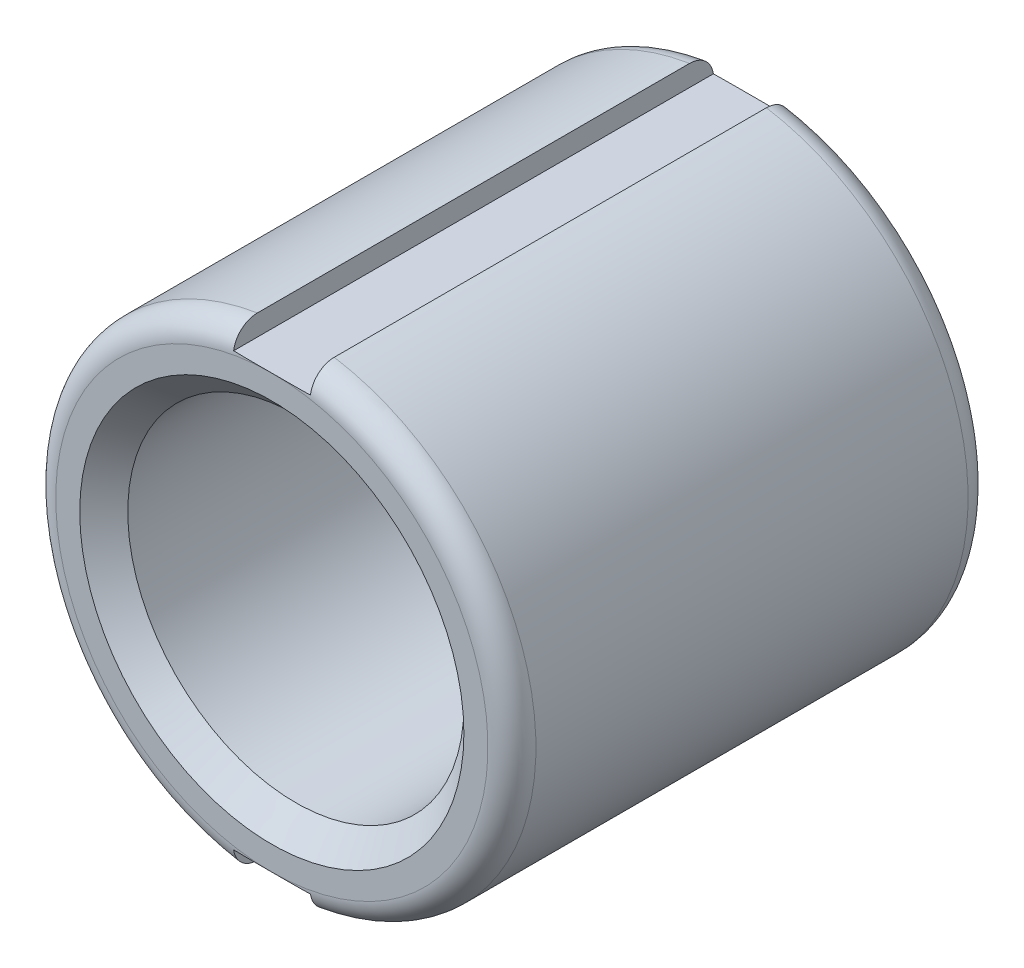
ISO-10303-21;
HEADER;
FILE_DESCRIPTION(('STEP AP214'),'2;1');
FILE_NAME('part.step','',(''),(''),'','','');
FILE_SCHEMA(('AUTOMOTIVE_DESIGN { 1 0 10303 214 1 1 1 1 }'));
ENDSEC;
DATA;
#1=APPLICATION_CONTEXT('core data for automotive mechanical design processes');
#2=APPLICATION_PROTOCOL_DEFINITION('international standard','automotive_design',2000,#1);
#3=PRODUCT_CONTEXT('',#1,'mechanical');
#4=PRODUCT('Part','Part','',(#3));
#5=PRODUCT_RELATED_PRODUCT_CATEGORY('part','',(#4));
#6=PRODUCT_DEFINITION_FORMATION('','',#4);
#7=PRODUCT_DEFINITION_CONTEXT('part definition',#1,'design');
#8=PRODUCT_DEFINITION('design','',#6,#7);
#9=PRODUCT_DEFINITION_SHAPE('','',#8);
#10=(LENGTH_UNIT() NAMED_UNIT(*) SI_UNIT(.MILLI.,.METRE.));
#11=(NAMED_UNIT(*) PLANE_ANGLE_UNIT() SI_UNIT($,.RADIAN.));
#12=(NAMED_UNIT(*) SI_UNIT($,.STERADIAN.) SOLID_ANGLE_UNIT());
#13=UNCERTAINTY_MEASURE_WITH_UNIT(LENGTH_MEASURE(1.E-05),#10,'distance_accuracy_value','');
#14=(GEOMETRIC_REPRESENTATION_CONTEXT(3) GLOBAL_UNCERTAINTY_ASSIGNED_CONTEXT((#13)) GLOBAL_UNIT_ASSIGNED_CONTEXT((#10,
#11,#12)) REPRESENTATION_CONTEXT('',''));
#15=CARTESIAN_POINT('',(0.,0.,0.));
#16=DIRECTION('',(0.,0.,1.));
#17=DIRECTION('',(1.,0.,0.));
#18=AXIS2_PLACEMENT_3D('',#15,#16,#17);
#19=CARTESIAN_POINT('',(0.,0.,0.));
#20=DIRECTION('',(0.,0.,1.));
#21=DIRECTION('',(1.,0.,0.));
#22=AXIS2_PLACEMENT_3D('',#19,#20,#21);
#23=CYLINDRICAL_SURFACE('',#22,3.5);
#24=CARTESIAN_POINT('',(0.,0.,0.500000668296252));
#25=DIRECTION('',(0.,0.,-1.));
#26=DIRECTION('',(-1.,0.,0.));
#27=AXIS2_PLACEMENT_3D('',#24,#25,#26);
#28=CIRCLE('',#27,3.50000155617636);
#29=CARTESIAN_POINT('',(-3.50000155617636,0.,0.500000668296252));
#30=VERTEX_POINT('',#29);
#31=EDGE_CURVE('E157',#30,#30,#28,.T.);
#32=ORIENTED_EDGE('',*,*,#31,.T.);
#33=EDGE_LOOP('',(#32));
#34=FACE_BOUND('',#33,.T.);
#35=CARTESIAN_POINT('',(0.,0.,9.49999933169465));
#36=DIRECTION('',(0.,0.,1.));
#37=DIRECTION('',(1.,0.,0.));
#38=AXIS2_PLACEMENT_3D('',#35,#36,#37);
#39=CIRCLE('',#38,3.50000155611951);
#40=CARTESIAN_POINT('',(3.50000155611951,0.,9.49999933169465));
#41=VERTEX_POINT('',#40);
#42=EDGE_CURVE('E108',#41,#41,#39,.T.);
#43=ORIENTED_EDGE('',*,*,#42,.T.);
#44=EDGE_LOOP('',(#43));
#45=FACE_BOUND('',#44,.T.);
#46=ADVANCED_FACE('F16',(#34,#45),#23,.F.);
#47=CARTESIAN_POINT('',(0.,0.,0.));
#48=DIRECTION('',(0.,0.,1.));
#49=DIRECTION('',(1.,0.,0.));
#50=AXIS2_PLACEMENT_3D('',#47,#48,#49);
#51=CYLINDRICAL_SURFACE('',#50,5.);
#52=CARTESIAN_POINT('',(0.,0.,9.5));
#53=DIRECTION('',(0.,0.,1.));
#54=DIRECTION('',(-0.999985814409762,0.0053264415179918,0.));
#55=AXIS2_PLACEMENT_3D('',#52,#53,#54);
#56=CIRCLE('',#55,5.);
#57=CARTESIAN_POINT('',(0.8,-4.93558507170123,9.5));
#58=VERTEX_POINT('',#57);
#59=CARTESIAN_POINT('',(0.8,4.93558507170123,9.5));
#60=VERTEX_POINT('',#59);
#61=EDGE_CURVE('E89',#58,#60,#56,.T.);
#62=ORIENTED_EDGE('',*,*,#61,.F.);
#63=DIRECTION('',(0.,0.,-1.));
#64=VECTOR('',#63,1.);
#65=CARTESIAN_POINT('',(0.8,-4.93558507170122,10.));
#66=LINE('',#65,#64);
#67=CARTESIAN_POINT('',(0.8,-4.93558507170123,0.5));
#68=VERTEX_POINT('',#67);
#69=EDGE_CURVE('E92',#58,#68,#66,.T.);
#70=ORIENTED_EDGE('',*,*,#69,.T.);
#71=CARTESIAN_POINT('',(0.,0.,0.5));
#72=DIRECTION('',(0.,0.,1.));
#73=DIRECTION('',(-0.999971373855159,-0.00756647012979169,0.));
#74=AXIS2_PLACEMENT_3D('',#71,#72,#73);
#75=CIRCLE('',#74,5.);
#76=CARTESIAN_POINT('',(0.8,4.93558507170123,0.5));
#77=VERTEX_POINT('',#76);
#78=EDGE_CURVE('E294',#77,#68,#75,.F.);
#79=ORIENTED_EDGE('',*,*,#78,.F.);
#80=DIRECTION('',(0.,0.,-1.));
#81=VECTOR('',#80,1.);
#82=CARTESIAN_POINT('',(0.8,4.93558507170122,10.));
#83=LINE('',#82,#81);
#84=EDGE_CURVE('E95',#77,#60,#83,.F.);
#85=ORIENTED_EDGE('',*,*,#84,.T.);
#86=EDGE_LOOP('',(#62,#70,#79,#85));
#87=FACE_BOUND('',#86,.T.);
#88=ADVANCED_FACE('F91',(#87),#51,.T.);
#89=CARTESIAN_POINT('',(0.8,-5.5,10.));
#90=DIRECTION('',(1.,0.,0.));
#91=DIRECTION('',(0.,0.,-1.));
#92=AXIS2_PLACEMENT_3D('',#89,#90,#91);
#93=PLANE('',#92);
#94=CARTESIAN_POINT('',(0.799999999999999,-4.93558507170123,0.5));
#95=CARTESIAN_POINT('',(0.799999999999999,-4.93561032535587,0.472142239938519));
#96=CARTESIAN_POINT('',(0.799999999999999,-4.9332280990744,0.444293560125993));
#97=CARTESIAN_POINT('',(0.8,-4.92383695020117,0.389416305297648));
#98=CARTESIAN_POINT('',(0.800000000000001,-4.91683289458156,0.362386898836657));
#99=CARTESIAN_POINT('',(0.800000000000001,-4.89838214932041,0.309878409520228));
#100=CARTESIAN_POINT('',(0.8,-4.88693378503542,0.28439991524956));
#101=CARTESIAN_POINT('',(0.8,-4.85994797345873,0.235717714075063));
#102=CARTESIAN_POINT('',(0.800000000000002,-4.84441127027912,0.212513594269689));
#103=CARTESIAN_POINT('',(0.800000000000002,-4.80960868399099,0.168890140455869));
#104=CARTESIAN_POINT('',(0.800000000000001,-4.79032319320717,0.148486455443453));
#105=CARTESIAN_POINT('',(0.799999999999999,-4.74863618241635,0.111157692405801));
#106=CARTESIAN_POINT('',(0.799999999999999,-4.72623435165118,0.0942329617157905));
#107=CARTESIAN_POINT('',(0.799999999999999,-4.67864143853591,0.0641049158333548));
#108=CARTESIAN_POINT('',(0.799999999999999,-4.65341750629682,0.0509535491889362));
#109=CARTESIAN_POINT('',(0.800000000000001,-4.6011736085027,0.0290311680150615));
#110=CARTESIAN_POINT('',(0.800000000000002,-4.5741565608496,0.0202532255802647));
#111=CARTESIAN_POINT('',(0.800000000000001,-4.53121938397591,0.0101181231965108));
#112=CARTESIAN_POINT('',(0.800000000000001,-4.51565627527713,0.0071954524475714));
#113=CARTESIAN_POINT('',(0.799999999999999,-4.5,0.00500345930988489));
#114=B_SPLINE_CURVE_WITH_KNOTS('',3,(#94,#95,#96,#97,#98,#99,#100,#101,#102,#103,#104,#105,#106,
#107,#108,#109,#110,#111,#112,#113),.UNSPECIFIED.,.F.,.F.,(4,2,2,2,2,2,2,2,2,4),(0.,
0.0834582261465901,0.166828707373061,0.2502306336609,0.333617390583446,0.417452636878405,
0.501296249137186,0.586244120600249,0.671056995563331,0.718490993678133),.UNSPECIFIED.);
#115=CARTESIAN_POINT('',(0.8,-4.5,0.00500345930988505));
#116=VERTEX_POINT('',#115);
#117=EDGE_CURVE('E106',#68,#116,#114,.T.);
#118=ORIENTED_EDGE('',*,*,#117,.F.);
#119=ORIENTED_EDGE('',*,*,#69,.F.);
#120=CARTESIAN_POINT('',(0.799999999999999,-4.50000000000001,9.99499654069011));
#121=CARTESIAN_POINT('',(0.800000000003339,-4.52845008995948,9.99102726234701));
#122=CARTESIAN_POINT('',(0.80000000000206,-4.55655799753854,9.98463378322027));
#123=CARTESIAN_POINT('',(0.79999999999794,-4.611312990404,9.96725562326724));
#124=CARTESIAN_POINT('',(0.799999999995099,-4.63796026705732,9.95627154551976));
#125=CARTESIAN_POINT('',(0.799999999995528,-4.68904531495508,9.92995796288271));
#126=CARTESIAN_POINT('',(0.799999999998802,-4.7134813483106,9.91462507858352));
#127=CARTESIAN_POINT('',(0.800000000001197,-4.75938912980065,9.88004391144214));
#128=CARTESIAN_POINT('',(0.800000000000321,-4.78086227872704,9.86079748956176));
#129=CARTESIAN_POINT('',(0.799999999999685,-4.82002026059259,9.8191179415494));
#130=CARTESIAN_POINT('',(0.799999999999915,-4.83773905813528,9.79671673527788));
#131=CARTESIAN_POINT('',(0.800000000000085,-4.86910243522778,9.74922441106862));
#132=CARTESIAN_POINT('',(0.800000000000024,-4.88274752932843,9.7241336333961));
#133=CARTESIAN_POINT('',(0.79999999999998,-4.90540197180442,9.67231304598103));
#134=CARTESIAN_POINT('',(0.799999999999995,-4.9144665136445,9.64560731737832));
#135=CARTESIAN_POINT('',(0.800000000000005,-4.92791606131762,9.59108622263885));
#136=CARTESIAN_POINT('',(0.799999999999999,-4.93231064733838,9.56327325011705));
#137=CARTESIAN_POINT('',(0.799999999999998,-4.93516503994077,9.52355829081837));
#138=CARTESIAN_POINT('',(0.799999999999998,-4.93558824722471,9.51177579488754));
#139=CARTESIAN_POINT('',(0.800000000000001,-4.93558507170123,9.5));
#140=B_SPLINE_CURVE_WITH_KNOTS('',3,(#120,#121,#122,#123,#124,#125,#126,#127,#128,#129,#130,
#131,#132,#133,#134,#135,#136,#137,#138,#139),.UNSPECIFIED.,.F.,.F.,(4,2,2,2,2,2,2,2,2,4),(0.,
0.0860724300575327,0.172133556110195,0.25826174341409,0.344349070497942,0.429620769168096,
0.514881692580213,0.599089183650414,0.683123591666845,0.718461359070084),.UNSPECIFIED.);
#141=CARTESIAN_POINT('',(0.800000000000001,-4.5,9.99499654069011));
#142=VERTEX_POINT('',#141);
#143=EDGE_CURVE('E100',#142,#58,#140,.T.);
#144=ORIENTED_EDGE('',*,*,#143,.F.);
#145=DIRECTION('',(0.,0.,1.));
#146=VECTOR('',#145,1.);
#147=CARTESIAN_POINT('',(0.800000000000002,-4.5,10.));
#148=LINE('',#147,#146);
#149=EDGE_CURVE('E293',#142,#116,#148,.F.);
#150=ORIENTED_EDGE('',*,*,#149,.T.);
#151=EDGE_LOOP('',(#118,#119,#144,#150));
#152=FACE_BOUND('',#151,.T.);
#153=ADVANCED_FACE('F103',(#152),#93,.F.);
#154=CARTESIAN_POINT('',(0.,0.,9.99999999993406));
#155=DIRECTION('',(0.,0.,1.));
#156=DIRECTION('',(1.,0.,0.));
#157=AXIS2_PLACEMENT_3D('',#154,#155,#156);
#158=CONICAL_SURFACE('',#157,4.00000254199995,0.785398481094791);
#159=ORIENTED_EDGE('',*,*,#42,.F.);
#160=EDGE_LOOP('',(#159));
#161=FACE_BOUND('',#160,.T.);
#162=CARTESIAN_POINT('',(0.,0.,9.99999999999091));
#163=DIRECTION('',(0.,0.,1.));
#164=DIRECTION('',(1.,0.,0.));
#165=AXIS2_PLACEMENT_3D('',#162,#163,#164);
#166=CIRCLE('',#165,4.00000254205679);
#167=CARTESIAN_POINT('',(4.00000254205679,0.,9.99999999999091));
#168=VERTEX_POINT('',#167);
#169=EDGE_CURVE('E347',#168,#168,#166,.F.);
#170=ORIENTED_EDGE('',*,*,#169,.F.);
#171=EDGE_LOOP('',(#170));
#172=FACE_BOUND('',#171,.T.);
#173=ADVANCED_FACE('F135',(#161,#172),#158,.F.);
#174=CARTESIAN_POINT('',(0.,0.,9.5));
#175=DIRECTION('',(0.,0.,1.));
#176=DIRECTION('',(-0.999985814409762,0.0053264415179918,0.));
#177=AXIS2_PLACEMENT_3D('',#174,#175,#176);
#178=TOROIDAL_SURFACE('',#177,4.5,0.5);
#179=ORIENTED_EDGE('',*,*,#61,.T.);
#180=CARTESIAN_POINT('',(0.800000000000001,4.93558507170123,9.5));
#181=CARTESIAN_POINT('',(0.800000000000001,4.93561032535586,9.52785776006148));
#182=CARTESIAN_POINT('',(0.800000000000001,4.9332280990744,9.55570643987401));
#183=CARTESIAN_POINT('',(0.799999999999999,4.92383695020116,9.61058369470235));
#184=CARTESIAN_POINT('',(0.799999999999999,4.91683289458156,9.63761310116334));
#185=CARTESIAN_POINT('',(0.799999999999999,4.8983821493204,9.69012159047977));
#186=CARTESIAN_POINT('',(0.800000000000001,4.88693378503541,9.71560008475044));
#187=CARTESIAN_POINT('',(0.799999999999999,4.85994797345873,9.76428228592494));
#188=CARTESIAN_POINT('',(0.799999999999996,4.84441127027911,9.78748640573031));
#189=CARTESIAN_POINT('',(0.799999999999995,4.80960868399099,9.83110985954413));
#190=CARTESIAN_POINT('',(0.799999999999998,4.79032319320717,9.85151354455655));
#191=CARTESIAN_POINT('',(0.800000000000002,4.74863618241635,9.8888423075942));
#192=CARTESIAN_POINT('',(0.800000000000003,4.72623435165118,9.90576703828421));
#193=CARTESIAN_POINT('',(0.800000000000002,4.67864143853591,9.93589508416664));
#194=CARTESIAN_POINT('',(0.799999999999999,4.65341750629682,9.94904645081106));
#195=CARTESIAN_POINT('',(0.8,4.6011736085027,9.97096883198494));
#196=CARTESIAN_POINT('',(0.800000000000004,4.5741565608496,9.97974677441973));
#197=CARTESIAN_POINT('',(0.800000000000004,4.53121938397591,9.98988187680349));
#198=CARTESIAN_POINT('',(0.800000000000003,4.51565627527713,9.99280454755243));
#199=CARTESIAN_POINT('',(0.8,4.50000000000001,9.99499654069011));
#200=B_SPLINE_CURVE_WITH_KNOTS('',3,(#180,#181,#182,#183,#184,#185,#186,#187,#188,#189,#190,
#191,#192,#193,#194,#195,#196,#197,#198,#199),.UNSPECIFIED.,.F.,.F.,(4,2,2,2,2,2,2,2,2,4),(0.,
0.0834582261465907,0.166828707373061,0.2502306336609,0.333617390583446,0.417452636878405,
0.501296249137185,0.586244120600247,0.671056995563331,0.718490993678126),.UNSPECIFIED.);
#201=CARTESIAN_POINT('',(0.800000000000001,4.5,9.99499654069011));
#202=VERTEX_POINT('',#201);
#203=EDGE_CURVE('E123',#60,#202,#200,.T.);
#204=ORIENTED_EDGE('',*,*,#203,.T.);
#205=CARTESIAN_POINT('',(0.800000000000002,4.5,9.99499654069012));
#206=CARTESIAN_POINT('',(0.733344461334272,4.5,9.99663365195973));
#207=CARTESIAN_POINT('',(0.666680461312616,4.5,9.99770096514002));
#208=CARTESIAN_POINT('',(0.533346087742878,4.5,9.99912184018491));
#209=CARTESIAN_POINT('',(0.466675714444805,4.5,9.9994754233789));
#210=CARTESIAN_POINT('',(0.333336097882169,4.5,9.99989472730253));
#211=CARTESIAN_POINT('',(0.26666685461492,4.5,9.99996045208806));
#212=CARTESIAN_POINT('',(0.133326303280786,4.5,10.0000000824359));
#213=CARTESIAN_POINT('',(0.066654995211742,4.5,9.99997398525395));
#214=CARTESIAN_POINT('',(-1.64804799254942E-05,4.5,10.));
#215=B_SPLINE_CURVE_WITH_KNOTS('',3,(#205,#206,#207,#208,#209,#210,#211,#212,#213,#214),
.UNSPECIFIED.,.F.,.F.,(4,2,2,2,4),(0.,0.200016874708182,0.400027771944378,0.60003585104753,
0.80004990770689),.UNSPECIFIED.);
#216=CARTESIAN_POINT('',(-1.64804799263147E-05,4.50000021942539,9.99999999999994));
#217=VERTEX_POINT('',#216);
#218=EDGE_CURVE('E115',#202,#217,#215,.T.);
#219=ORIENTED_EDGE('',*,*,#218,.T.);
#220=CARTESIAN_POINT('',(0.,0.,9.99999999999991));
#221=DIRECTION('',(0.,0.,-1.));
#222=DIRECTION('',(-3.66232863427582E-06,0.999999999993293,0.));
#223=AXIS2_PLACEMENT_3D('',#220,#221,#222);
#224=CIRCLE('',#223,4.50000029300371);
#225=CARTESIAN_POINT('',(1.62758198530875E-05,-4.50000021820692,9.99999999999994));
#226=VERTEX_POINT('',#225);
#227=EDGE_CURVE('E148',#226,#217,#224,.F.);
#228=ORIENTED_EDGE('',*,*,#227,.F.);
#229=CARTESIAN_POINT('',(1.62758198533338E-05,-4.5,10.));
#230=CARTESIAN_POINT('',(0.0666850218145762,-4.5,9.99997398959712));
#231=CARTESIAN_POINT('',(0.133353600268118,-4.5,10.000000082437));
#232=CARTESIAN_POINT('',(0.266688692360293,-4.5,9.99996043270109));
#233=CARTESIAN_POINT('',(0.333355206001086,-4.5,9.99989469286998));
#234=CARTESIAN_POINT('',(0.466689363027923,-4.5,9.99947535481787));
#235=CARTESIAN_POINT('',(0.533357006416649,-4.5,9.99912175254108));
#236=CARTESIAN_POINT('',(0.666685920379369,-4.5,9.99770087981886));
#237=CARTESIAN_POINT('',(0.733347190703352,-4.5,9.99663358804452));
#238=CARTESIAN_POINT('',(0.800000000000001,-4.5,9.99499654069012));
#239=B_SPLINE_CURVE_WITH_KNOTS('',3,(#229,#230,#231,#232,#233,#234,#235,#236,#237,#238),
.UNSPECIFIED.,.F.,.F.,(4,2,2,2,4),(0.,0.200005867720801,0.400005757922168,0.600008466035796,
0.800017151584641),.UNSPECIFIED.);
#240=EDGE_CURVE('E113',#226,#142,#239,.T.);
#241=ORIENTED_EDGE('',*,*,#240,.T.);
#242=ORIENTED_EDGE('',*,*,#143,.T.);
#243=EDGE_LOOP('',(#179,#204,#219,#228,#241,#242));
#244=FACE_BOUND('',#243,.T.);
#245=ADVANCED_FACE('F110',(#244),#178,.T.);
#246=CARTESIAN_POINT('',(0.8,4.5,10.));
#247=DIRECTION('',(1.,0.,0.));
#248=DIRECTION('',(0.,0.,-1.));
#249=AXIS2_PLACEMENT_3D('',#246,#247,#248);
#250=PLANE('',#249);
#251=ORIENTED_EDGE('',*,*,#203,.F.);
#252=ORIENTED_EDGE('',*,*,#84,.F.);
#253=CARTESIAN_POINT('',(0.8,4.5,0.00500345930988478));
#254=CARTESIAN_POINT('',(0.800000000003342,4.52845008995948,0.0089727376529909));
#255=CARTESIAN_POINT('',(0.800000000002062,4.55655799753853,0.0153662167797315));
#256=CARTESIAN_POINT('',(0.799999999997939,4.611312990404,0.0327443767327543));
#257=CARTESIAN_POINT('',(0.799999999995096,4.63796026705732,0.0437284544802352));
#258=CARTESIAN_POINT('',(0.799999999995525,4.68904531495508,0.0700420371172882));
#259=CARTESIAN_POINT('',(0.799999999998801,4.7134813483106,0.0853749214164788));
#260=CARTESIAN_POINT('',(0.800000000001198,4.75938912980065,0.119956088557856));
#261=CARTESIAN_POINT('',(0.80000000000032,4.78086227872704,0.139202510438233));
#262=CARTESIAN_POINT('',(0.799999999999684,4.82002026059259,0.180882058450603));
#263=CARTESIAN_POINT('',(0.799999999999915,4.83773905813528,0.203283264722114));
#264=CARTESIAN_POINT('',(0.800000000000085,4.86910243522778,0.250775588931374));
#265=CARTESIAN_POINT('',(0.800000000000024,4.88274752932843,0.275866366603897));
#266=CARTESIAN_POINT('',(0.799999999999979,4.90540197180442,0.327686954018964));
#267=CARTESIAN_POINT('',(0.799999999999993,4.9144665136445,0.354392682621678));
#268=CARTESIAN_POINT('',(0.800000000000007,4.92791606131762,0.40891377736115));
#269=CARTESIAN_POINT('',(0.800000000000005,4.93231064733838,0.436726749882947));
#270=CARTESIAN_POINT('',(0.800000000000001,4.93516503994077,0.476441709181632));
#271=CARTESIAN_POINT('',(0.8,4.93558824722471,0.488224205112462));
#272=CARTESIAN_POINT('',(0.799999999999999,4.93558507170123,0.5));
#273=B_SPLINE_CURVE_WITH_KNOTS('',3,(#253,#254,#255,#256,#257,#258,#259,#260,#261,#262,#263,
#264,#265,#266,#267,#268,#269,#270,#271,#272),.UNSPECIFIED.,.F.,.F.,(4,2,2,2,2,2,2,2,2,4),(0.,
0.0860724300575342,0.172133556110198,0.258261743414094,0.344349070497948,0.429620769168102,
0.514881692580217,0.599089183650419,0.68312359166685,0.718461359070095),.UNSPECIFIED.);
#274=CARTESIAN_POINT('',(0.8,4.5,0.00500345930988478));
#275=VERTEX_POINT('',#274);
#276=EDGE_CURVE('E160',#275,#77,#273,.T.);
#277=ORIENTED_EDGE('',*,*,#276,.F.);
#278=DIRECTION('',(0.,0.,-1.));
#279=VECTOR('',#278,1.);
#280=CARTESIAN_POINT('',(0.8,4.5,10.));
#281=LINE('',#280,#279);
#282=EDGE_CURVE('E355',#275,#202,#281,.F.);
#283=ORIENTED_EDGE('',*,*,#282,.T.);
#284=EDGE_LOOP('',(#251,#252,#277,#283));
#285=FACE_BOUND('',#284,.T.);
#286=ADVANCED_FACE('F134',(#285),#250,.F.);
#287=CARTESIAN_POINT('',(0.,0.,5.6843418860808E-11));
#288=DIRECTION('',(0.,0.,-1.));
#289=DIRECTION('',(-1.,0.,0.));
#290=AXIS2_PLACEMENT_3D('',#287,#288,#289);
#291=CONICAL_SURFACE('',#290,4.00000254217048,0.785398481151634);
#292=ORIENTED_EDGE('',*,*,#31,.F.);
#293=EDGE_LOOP('',(#292));
#294=FACE_BOUND('',#293,.T.);
#295=CARTESIAN_POINT('',(0.,0.,5.6843418860808E-11));
#296=DIRECTION('',(0.,0.,-1.));
#297=DIRECTION('',(-1.,0.,0.));
#298=AXIS2_PLACEMENT_3D('',#295,#296,#297);
#299=CIRCLE('',#298,4.00000254217048);
#300=CARTESIAN_POINT('',(-4.00000254217048,0.,5.6843418860808E-11));
#301=VERTEX_POINT('',#300);
#302=EDGE_CURVE('E260',#301,#301,#299,.T.);
#303=ORIENTED_EDGE('',*,*,#302,.T.);
#304=EDGE_LOOP('',(#303));
#305=FACE_BOUND('',#304,.T.);
#306=ADVANCED_FACE('F287',(#294,#305),#291,.F.);
#307=CARTESIAN_POINT('',(0.,0.,0.5));
#308=DIRECTION('',(0.,0.,1.));
#309=DIRECTION('',(-0.999971373855159,-0.00756647012979169,0.));
#310=AXIS2_PLACEMENT_3D('',#307,#308,#309);
#311=TOROIDAL_SURFACE('',#310,4.5,0.5);
#312=CARTESIAN_POINT('',(0.799999999999999,-4.5,0.00500345930988467));
#313=CARTESIAN_POINT('',(0.733345836201673,-4.5,0.00336638023626906));
#314=CARTESIAN_POINT('',(0.666683211212941,-4.5,0.00229907783861924));
#315=CARTESIAN_POINT('',(0.533351587815675,-4.5,0.000878203963372319));
#316=CARTESIAN_POINT('',(0.466682589657151,-4.5,0.000524611156621396));
#317=CARTESIAN_POINT('',(0.333345723231111,-4.5,0.000105290041417163));
#318=CARTESIAN_POINT('',(0.26667785496091,-4.5,3.95576771291826E-05));
#319=CARTESIAN_POINT('',(0.133340053615356,-4.5,-8.24366977575884E-08));
#320=CARTESIAN_POINT('',(0.0666701205378419,-4.5,2.60125581932159E-05));
#321=CARTESIAN_POINT('',(1.98787304230897E-08,-4.5,0.));
#322=B_SPLINE_CURVE_WITH_KNOTS('',3,(#312,#313,#314,#315,#316,#317,#318,#319,#320,#321),
.UNSPECIFIED.,.F.,.F.,(4,2,2,2,4),(0.,0.200012749576009,0.400019521698549,0.600023475799261,
0.80003340743766),.UNSPECIFIED.);
#323=CARTESIAN_POINT('',(1.98787300884372E-08,-4.50000000014344,0.));
#324=VERTEX_POINT('',#323);
#325=EDGE_CURVE('E338',#116,#324,#322,.T.);
#326=ORIENTED_EDGE('',*,*,#325,.T.);
#327=CARTESIAN_POINT('',(0.,0.,0.));
#328=DIRECTION('',(0.,0.,1.));
#329=DIRECTION('',(4.41749556354919E-09,-1.,0.));
#330=AXIS2_PLACEMENT_3D('',#327,#328,#329);
#331=CIRCLE('',#330,4.50000000019725);
#332=CARTESIAN_POINT('',(4.50000000008891,0.,0.));
#333=VERTEX_POINT('',#332);
#334=EDGE_CURVE('E252',#324,#333,#331,.T.);
#335=ORIENTED_EDGE('',*,*,#334,.T.);
#336=CARTESIAN_POINT('',(0.,0.,0.));
#337=DIRECTION('',(0.,0.,1.));
#338=DIRECTION('',(1.,0.,0.));
#339=AXIS2_PLACEMENT_3D('',#336,#337,#338);
#340=CIRCLE('',#339,4.5000000000528);
#341=CARTESIAN_POINT('',(-2.20444814632359E-08,4.50000000010738,0.));
#342=VERTEX_POINT('',#341);
#343=EDGE_CURVE('E246',#333,#342,#340,.T.);
#344=ORIENTED_EDGE('',*,*,#343,.T.);
#345=CARTESIAN_POINT('',(-2.20444806072612E-08,4.5,0.));
#346=CARTESIAN_POINT('',(0.0666700821082385,4.5,2.60125637518218E-05));
#347=CARTESIAN_POINT('',(0.133340018679256,4.5,-8.24366963839623E-08));
#348=CARTESIAN_POINT('',(0.266677827011831,4.5,3.95576523166573E-05));
#349=CARTESIAN_POINT('',(0.33334569877555,4.5,0.000105289997348502));
#350=CARTESIAN_POINT('',(0.466682572188987,4.5,0.000524611068873394));
#351=CARTESIAN_POINT('',(0.53335157384139,4.5,0.000878203851201231));
#352=CARTESIAN_POINT('',(0.666683204226145,4.5,0.00229907772942093));
#353=CARTESIAN_POINT('',(0.733345832708486,4.5,0.00336638015446722));
#354=CARTESIAN_POINT('',(0.8,4.5,0.00500345930988478));
#355=B_SPLINE_CURVE_WITH_KNOTS('',3,(#345,#346,#347,#348,#349,#350,#351,#352,#353,#354),
.UNSPECIFIED.,.F.,.F.,(4,2,2,2,4),(0.,0.200009942119028,0.40001390670032,0.600020689303724,
0.800033449360644),.UNSPECIFIED.);
#356=EDGE_CURVE('E265',#342,#275,#355,.T.);
#357=ORIENTED_EDGE('',*,*,#356,.T.);
#358=ORIENTED_EDGE('',*,*,#276,.T.);
#359=ORIENTED_EDGE('',*,*,#78,.T.);
#360=ORIENTED_EDGE('',*,*,#117,.T.);
#361=EDGE_LOOP('',(#326,#335,#344,#357,#358,#359,#360));
#362=FACE_BOUND('',#361,.T.);
#363=ADVANCED_FACE('F281',(#362),#311,.T.);
#364=CARTESIAN_POINT('',(0.8,-4.5,10.));
#365=DIRECTION('',(0.,1.,0.));
#366=DIRECTION('',(0.,0.,1.));
#367=AXIS2_PLACEMENT_3D('',#364,#365,#366);
#368=PLANE('',#367);
#369=ORIENTED_EDGE('',*,*,#325,.F.);
#370=ORIENTED_EDGE('',*,*,#149,.F.);
#371=ORIENTED_EDGE('',*,*,#240,.F.);
#372=CARTESIAN_POINT('',(-0.800000000000002,-4.5,9.99499654069012));
#373=CARTESIAN_POINT('',(-0.733344478387262,-4.5,9.99663365156039));
#374=CARTESIAN_POINT('',(-0.66668049542065,-4.5,9.99770096460694));
#375=CARTESIAN_POINT('',(-0.533346155962323,-4.5,9.99912183963733));
#376=CARTESIAN_POINT('',(-0.466675799720616,-4.5,9.99947542295055));
#377=CARTESIAN_POINT('',(-0.333336217268945,-4.5,9.99989472708742));
#378=CARTESIAN_POINT('',(-0.266666991056294,-4.5,9.99996045196694));
#379=CARTESIAN_POINT('',(-0.13332647383129,-4.5,10.0000000824359));
#380=CARTESIAN_POINT('',(-0.0666551828167758,-4.5,9.99997398528108));
#381=CARTESIAN_POINT('',(1.62758198524665E-05,-4.5,10.));
#382=B_SPLINE_CURVE_WITH_KNOTS('',3,(#372,#373,#374,#375,#376,#377,#378,#379,#380,#381),
.UNSPECIFIED.,.F.,.F.,(4,2,2,2,4),(0.,0.200016823542637,0.400027669613517,0.600035697552733,
0.800049703047926),.UNSPECIFIED.);
#383=CARTESIAN_POINT('',(-0.800000000000001,-4.5,9.99499654069011));
#384=VERTEX_POINT('',#383);
#385=EDGE_CURVE('E313',#384,#226,#382,.T.);
#386=ORIENTED_EDGE('',*,*,#385,.F.);
#387=DIRECTION('',(0.,0.,1.));
#388=VECTOR('',#387,1.);
#389=CARTESIAN_POINT('',(-0.8,-4.50000000000001,10.));
#390=LINE('',#389,#388);
#391=CARTESIAN_POINT('',(-0.8,-4.5,0.00500345930988505));
#392=VERTEX_POINT('',#391);
#393=EDGE_CURVE('E204',#384,#392,#390,.F.);
#394=ORIENTED_EDGE('',*,*,#393,.T.);
#395=CARTESIAN_POINT('',(1.98787286883662E-08,-4.5,0.));
#396=CARTESIAN_POINT('',(-0.0666700840935108,-4.5,2.6012563464641E-05));
#397=CARTESIAN_POINT('',(-0.133340020484054,-4.5,-8.24366964687947E-08));
#398=CARTESIAN_POINT('',(-0.26667782845568,-4.5,3.95576535984809E-05));
#399=CARTESIAN_POINT('',(-0.333345700038923,-4.5,0.000105289999625111));
#400=CARTESIAN_POINT('',(-0.466682573091392,-4.5,0.000524611073406447));
#401=CARTESIAN_POINT('',(-0.533351574563302,-4.5,0.000878203856995937));
#402=CARTESIAN_POINT('',(-0.666683204587083,-4.5,0.002299077735062));
#403=CARTESIAN_POINT('',(-0.733345832888944,-4.5,0.00336638015869296));
#404=CARTESIAN_POINT('',(-0.8,-4.5,0.00500345930988467));
#405=B_SPLINE_CURVE_WITH_KNOTS('',3,(#395,#396,#397,#398,#399,#400,#401,#402,#403,#404),
.UNSPECIFIED.,.F.,.F.,(4,2,2,2,4),(0.,0.200009941577599,0.400013905617465,0.600020687679428,
0.800033447194904),.UNSPECIFIED.);
#406=EDGE_CURVE('E340',#324,#392,#405,.T.);
#407=ORIENTED_EDGE('',*,*,#406,.F.);
#408=EDGE_LOOP('',(#369,#370,#371,#386,#394,#407));
#409=FACE_BOUND('',#408,.T.);
#410=ADVANCED_FACE('F286',(#409),#368,.F.);
#411=CARTESIAN_POINT('',(0.,0.,10.));
#412=DIRECTION('',(0.,0.,1.));
#413=DIRECTION('',(1.,0.,0.));
#414=AXIS2_PLACEMENT_3D('',#411,#412,#413);
#415=PLANE('',#414);
#416=ORIENTED_EDGE('',*,*,#227,.T.);
#417=CARTESIAN_POINT('',(0.,0.,9.99999999999991));
#418=DIRECTION('',(0.,0.,-1.));
#419=DIRECTION('',(3.61684862251804E-06,-0.999999999993459,0.));
#420=AXIS2_PLACEMENT_3D('',#417,#418,#419);
#421=CIRCLE('',#420,4.50000029056565);
#422=EDGE_CURVE('E240',#226,#217,#421,.T.);
#423=ORIENTED_EDGE('',*,*,#422,.F.);
#424=EDGE_LOOP('',(#416,#423));
#425=FACE_BOUND('',#424,.T.);
#426=ORIENTED_EDGE('',*,*,#169,.T.);
#427=EDGE_LOOP('',(#426));
#428=FACE_BOUND('',#427,.T.);
#429=ADVANCED_FACE('F372',(#425,#428),#415,.T.);
#430=CARTESIAN_POINT('',(-0.8,4.5,10.));
#431=DIRECTION('',(0.,-1.,0.));
#432=DIRECTION('',(0.,0.,-1.));
#433=AXIS2_PLACEMENT_3D('',#430,#431,#432);
#434=PLANE('',#433);
#435=CARTESIAN_POINT('',(-0.799999999999999,4.5,0.00500345930988467));
#436=CARTESIAN_POINT('',(-0.733345836382131,4.5,0.00336638024049498));
#437=CARTESIAN_POINT('',(-0.666683211573879,4.5,0.00229907784426046));
#438=CARTESIAN_POINT('',(-0.533351588537586,4.5,0.000878203969167085));
#439=CARTESIAN_POINT('',(-0.466682590559555,4.5,0.000524611161154444));
#440=CARTESIAN_POINT('',(-0.333345724494484,4.5,0.000105290043693719));
#441=CARTESIAN_POINT('',(-0.266677856404758,4.5,3.95576784109719E-05));
#442=CARTESIAN_POINT('',(-0.133340055420153,4.5,-8.24366978394263E-08));
#443=CARTESIAN_POINT('',(-0.0666701225231134,4.5,2.60125579060572E-05));
#444=CARTESIAN_POINT('',(-2.20444814678466E-08,4.5,0.));
#445=B_SPLINE_CURVE_WITH_KNOTS('',3,(#435,#436,#437,#438,#439,#440,#441,#442,#443,#444),
.UNSPECIFIED.,.F.,.F.,(4,2,2,2,4),(0.,0.200012749034566,0.400019520615665,0.60002347417495,
0.800033405271921),.UNSPECIFIED.);
#446=CARTESIAN_POINT('',(-0.8,4.5,0.005003459309885));
#447=VERTEX_POINT('',#446);
#448=EDGE_CURVE('E268',#447,#342,#445,.T.);
#449=ORIENTED_EDGE('',*,*,#448,.F.);
#450=DIRECTION('',(0.,0.,1.));
#451=VECTOR('',#450,1.);
#452=CARTESIAN_POINT('',(-0.8,4.5,10.));
#453=LINE('',#452,#451);
#454=CARTESIAN_POINT('',(-0.8,4.5,9.99499654069011));
#455=VERTEX_POINT('',#454);
#456=EDGE_CURVE('E196',#447,#455,#453,.T.);
#457=ORIENTED_EDGE('',*,*,#456,.T.);
#458=CARTESIAN_POINT('',(-1.6480479926365E-05,4.5,10.));
#459=CARTESIAN_POINT('',(-0.0666852094196099,4.5,9.99997398962426));
#460=CARTESIAN_POINT('',(-0.133353770818622,4.5,10.000000082437));
#461=CARTESIAN_POINT('',(-0.266688828801667,4.5,9.99996043257995));
#462=CARTESIAN_POINT('',(-0.333355325387862,4.5,9.99989469265483));
#463=CARTESIAN_POINT('',(-0.466689448303733,4.5,9.99947535438948));
#464=CARTESIAN_POINT('',(-0.533357074636092,4.5,9.99912175199347));
#465=CARTESIAN_POINT('',(-0.666685954487403,4.5,9.99770087928578));
#466=CARTESIAN_POINT('',(-0.733347207756341,4.5,9.99663358764518));
#467=CARTESIAN_POINT('',(-0.8,4.5,9.99499654069012));
#468=B_SPLINE_CURVE_WITH_KNOTS('',3,(#458,#459,#460,#461,#462,#463,#464,#465,#466,#467),
.UNSPECIFIED.,.F.,.F.,(4,2,2,2,4),(0.,0.200005816556635,0.400005655594065,0.600008312542377,
0.800016946925676),.UNSPECIFIED.);
#469=EDGE_CURVE('E239',#217,#455,#468,.T.);
#470=ORIENTED_EDGE('',*,*,#469,.F.);
#471=ORIENTED_EDGE('',*,*,#218,.F.);
#472=ORIENTED_EDGE('',*,*,#282,.F.);
#473=ORIENTED_EDGE('',*,*,#356,.F.);
#474=EDGE_LOOP('',(#449,#457,#470,#471,#472,#473));
#475=FACE_BOUND('',#474,.T.);
#476=ADVANCED_FACE('F278',(#475),#434,.F.);
#477=CARTESIAN_POINT('',(0.,0.,0.));
#478=DIRECTION('',(0.,0.,1.));
#479=DIRECTION('',(1.,0.,0.));
#480=AXIS2_PLACEMENT_3D('',#477,#478,#479);
#481=PLANE('',#480);
#482=ORIENTED_EDGE('',*,*,#334,.F.);
#483=CARTESIAN_POINT('',(0.,0.,0.));
#484=DIRECTION('',(0.,0.,1.));
#485=DIRECTION('',(-4.89877391383228E-09,1.,0.));
#486=AXIS2_PLACEMENT_3D('',#483,#484,#485);
#487=CIRCLE('',#486,4.50000000016125);
#488=EDGE_CURVE('E169',#342,#324,#487,.T.);
#489=ORIENTED_EDGE('',*,*,#488,.F.);
#490=ORIENTED_EDGE('',*,*,#343,.F.);
#491=EDGE_LOOP('',(#482,#489,#490));
#492=FACE_BOUND('',#491,.T.);
#493=ORIENTED_EDGE('',*,*,#302,.F.);
#494=EDGE_LOOP('',(#493));
#495=FACE_BOUND('',#494,.T.);
#496=ADVANCED_FACE('F393',(#492,#495),#481,.F.);
#497=CARTESIAN_POINT('',(-0.8,-4.5,10.));
#498=DIRECTION('',(-1.,0.,0.));
#499=DIRECTION('',(0.,0.,1.));
#500=AXIS2_PLACEMENT_3D('',#497,#498,#499);
#501=PLANE('',#500);
#502=CARTESIAN_POINT('',(-0.800000000000001,-4.93558507170123,9.5));
#503=CARTESIAN_POINT('',(-0.800000000000001,-4.93561032535586,9.52785776006148));
#504=CARTESIAN_POINT('',(-0.800000000000001,-4.9332280990744,9.55570643987401));
#505=CARTESIAN_POINT('',(-0.799999999999999,-4.92383695020116,9.61058369470235));
#506=CARTESIAN_POINT('',(-0.799999999999999,-4.91683289458156,9.63761310116334));
#507=CARTESIAN_POINT('',(-0.799999999999999,-4.8983821493204,9.69012159047977));
#508=CARTESIAN_POINT('',(-0.800000000000001,-4.88693378503541,9.71560008475044));
#509=CARTESIAN_POINT('',(-0.799999999999999,-4.85994797345873,9.76428228592494));
#510=CARTESIAN_POINT('',(-0.799999999999996,-4.84441127027911,9.78748640573031));
#511=CARTESIAN_POINT('',(-0.799999999999995,-4.80960868399099,9.83110985954413));
#512=CARTESIAN_POINT('',(-0.799999999999998,-4.79032319320717,9.85151354455655));
#513=CARTESIAN_POINT('',(-0.800000000000002,-4.74863618241635,9.8888423075942));
#514=CARTESIAN_POINT('',(-0.800000000000003,-4.72623435165118,9.90576703828421));
#515=CARTESIAN_POINT('',(-0.800000000000002,-4.67864143853591,9.93589508416664));
#516=CARTESIAN_POINT('',(-0.799999999999999,-4.65341750629682,9.94904645081106));
#517=CARTESIAN_POINT('',(-0.800000000000001,-4.6011736085027,9.97096883198494));
#518=CARTESIAN_POINT('',(-0.800000000000005,-4.5741565608496,9.97974677441973));
#519=CARTESIAN_POINT('',(-0.800000000000004,-4.53121938397591,9.98988187680349));
#520=CARTESIAN_POINT('',(-0.800000000000002,-4.51565627527713,9.99280454755243));
#521=CARTESIAN_POINT('',(-0.799999999999998,-4.5,9.99499654069012));
#522=B_SPLINE_CURVE_WITH_KNOTS('',3,(#502,#503,#504,#505,#506,#507,#508,#509,#510,#511,#512,
#513,#514,#515,#516,#517,#518,#519,#520,#521),.UNSPECIFIED.,.F.,.F.,(4,2,2,2,2,2,2,2,2,4),(0.,
0.0834582261465907,0.166828707373061,0.2502306336609,0.333617390583446,0.417452636878405,
0.501296249137185,0.586244120600247,0.671056995563331,0.718490993678129),.UNSPECIFIED.);
#523=CARTESIAN_POINT('',(-0.800000000000011,-4.93558507170123,9.5));
#524=VERTEX_POINT('',#523);
#525=EDGE_CURVE('E234',#524,#384,#522,.T.);
#526=ORIENTED_EDGE('',*,*,#525,.F.);
#527=DIRECTION('',(0.,0.,1.));
#528=VECTOR('',#527,1.);
#529=CARTESIAN_POINT('',(-0.80000000000002,-4.93558507170122,0.));
#530=LINE('',#529,#528);
#531=CARTESIAN_POINT('',(-0.80000000000001,-4.93558507170123,0.5));
#532=VERTEX_POINT('',#531);
#533=EDGE_CURVE('E193',#532,#524,#530,.T.);
#534=ORIENTED_EDGE('',*,*,#533,.F.);
#535=CARTESIAN_POINT('',(-0.8,-4.5,0.00500345930988478));
#536=CARTESIAN_POINT('',(-0.800000000003342,-4.52845008995948,0.0089727376529909));
#537=CARTESIAN_POINT('',(-0.800000000002062,-4.55655799753853,0.0153662167797315));
#538=CARTESIAN_POINT('',(-0.799999999997939,-4.611312990404,0.0327443767327543));
#539=CARTESIAN_POINT('',(-0.799999999995096,-4.63796026705732,0.0437284544802352));
#540=CARTESIAN_POINT('',(-0.799999999995525,-4.68904531495508,0.0700420371172882));
#541=CARTESIAN_POINT('',(-0.799999999998801,-4.7134813483106,0.0853749214164788));
#542=CARTESIAN_POINT('',(-0.800000000001198,-4.75938912980065,0.119956088557856));
#543=CARTESIAN_POINT('',(-0.80000000000032,-4.78086227872704,0.139202510438233));
#544=CARTESIAN_POINT('',(-0.799999999999684,-4.82002026059259,0.180882058450603));
#545=CARTESIAN_POINT('',(-0.799999999999915,-4.83773905813528,0.203283264722114));
#546=CARTESIAN_POINT('',(-0.800000000000085,-4.86910243522778,0.250775588931374));
#547=CARTESIAN_POINT('',(-0.800000000000024,-4.88274752932843,0.275866366603897));
#548=CARTESIAN_POINT('',(-0.799999999999979,-4.90540197180442,0.327686954018964));
#549=CARTESIAN_POINT('',(-0.799999999999993,-4.9144665136445,0.354392682621678));
#550=CARTESIAN_POINT('',(-0.800000000000007,-4.92791606131762,0.40891377736115));
#551=CARTESIAN_POINT('',(-0.800000000000005,-4.93231064733838,0.436726749882947));
#552=CARTESIAN_POINT('',(-0.800000000000001,-4.93516503994077,0.476441709181632));
#553=CARTESIAN_POINT('',(-0.8,-4.93558824722471,0.488224205112462));
#554=CARTESIAN_POINT('',(-0.799999999999999,-4.93558507170123,0.5));
#555=B_SPLINE_CURVE_WITH_KNOTS('',3,(#535,#536,#537,#538,#539,#540,#541,#542,#543,#544,#545,
#546,#547,#548,#549,#550,#551,#552,#553,#554),.UNSPECIFIED.,.F.,.F.,(4,2,2,2,2,2,2,2,2,4),(0.,
0.0860724300575342,0.172133556110198,0.258261743414094,0.344349070497948,0.429620769168102,
0.514881692580217,0.599089183650419,0.68312359166685,0.718461359070095),.UNSPECIFIED.);
#556=EDGE_CURVE('E170',#392,#532,#555,.T.);
#557=ORIENTED_EDGE('',*,*,#556,.F.);
#558=ORIENTED_EDGE('',*,*,#393,.F.);
#559=EDGE_LOOP('',(#526,#534,#557,#558));
#560=FACE_BOUND('',#559,.T.);
#561=ADVANCED_FACE('F209',(#560),#501,.F.);
#562=CARTESIAN_POINT('',(0.,0.,9.5));
#563=DIRECTION('',(0.,0.,1.));
#564=DIRECTION('',(0.999985814409762,-0.0053264415179918,0.));
#565=AXIS2_PLACEMENT_3D('',#562,#563,#564);
#566=TOROIDAL_SURFACE('',#565,4.5,0.5);
#567=CARTESIAN_POINT('',(0.,0.,9.5));
#568=DIRECTION('',(0.,0.,1.));
#569=DIRECTION('',(1.,0.,0.));
#570=AXIS2_PLACEMENT_3D('',#567,#568,#569);
#571=CIRCLE('',#570,5.);
#572=CARTESIAN_POINT('',(-0.800000000000009,4.93558507170123,9.5));
#573=VERTEX_POINT('',#572);
#574=EDGE_CURVE('E191',#524,#573,#571,.F.);
#575=ORIENTED_EDGE('',*,*,#574,.F.);
#576=ORIENTED_EDGE('',*,*,#525,.T.);
#577=ORIENTED_EDGE('',*,*,#385,.T.);
#578=ORIENTED_EDGE('',*,*,#422,.T.);
#579=ORIENTED_EDGE('',*,*,#469,.T.);
#580=CARTESIAN_POINT('',(-0.800000000000001,4.5,9.99499654069011));
#581=CARTESIAN_POINT('',(-0.80000000000334,4.52845008995948,9.99102726234701));
#582=CARTESIAN_POINT('',(-0.800000000002061,4.55655799753853,9.98463378322027));
#583=CARTESIAN_POINT('',(-0.79999999999794,4.611312990404,9.96725562326724));
#584=CARTESIAN_POINT('',(-0.799999999995099,4.63796026705732,9.95627154551976));
#585=CARTESIAN_POINT('',(-0.799999999995528,4.68904531495508,9.92995796288271));
#586=CARTESIAN_POINT('',(-0.799999999998802,4.7134813483106,9.91462507858352));
#587=CARTESIAN_POINT('',(-0.800000000001197,4.75938912980065,9.88004391144214));
#588=CARTESIAN_POINT('',(-0.800000000000319,4.78086227872704,9.86079748956177));
#589=CARTESIAN_POINT('',(-0.799999999999683,4.82002026059259,9.8191179415494));
#590=CARTESIAN_POINT('',(-0.799999999999915,4.83773905813528,9.79671673527788));
#591=CARTESIAN_POINT('',(-0.800000000000085,4.86910243522778,9.74922441106862));
#592=CARTESIAN_POINT('',(-0.800000000000024,4.88274752932843,9.7241336333961));
#593=CARTESIAN_POINT('',(-0.79999999999998,4.90540197180442,9.67231304598103));
#594=CARTESIAN_POINT('',(-0.799999999999995,4.9144665136445,9.64560731737832));
#595=CARTESIAN_POINT('',(-0.800000000000005,4.92791606131762,9.59108622263885));
#596=CARTESIAN_POINT('',(-0.799999999999999,4.93231064733838,9.56327325011705));
#597=CARTESIAN_POINT('',(-0.799999999999998,4.93516503994077,9.52355829081837));
#598=CARTESIAN_POINT('',(-0.799999999999998,4.93558824722471,9.51177579488754));
#599=CARTESIAN_POINT('',(-0.800000000000001,4.93558507170123,9.5));
#600=B_SPLINE_CURVE_WITH_KNOTS('',3,(#580,#581,#582,#583,#584,#585,#586,#587,#588,#589,#590,
#591,#592,#593,#594,#595,#596,#597,#598,#599),.UNSPECIFIED.,.F.,.F.,(4,2,2,2,2,2,2,2,2,4),(0.,
0.0860724300575332,0.172133556110195,0.258261743414091,0.344349070497943,0.429620769168099,
0.514881692580212,0.599089183650415,0.683123591666846,0.718461359070089),.UNSPECIFIED.);
#601=EDGE_CURVE('E199',#455,#573,#600,.T.);
#602=ORIENTED_EDGE('',*,*,#601,.T.);
#603=EDGE_LOOP('',(#575,#576,#577,#578,#579,#602));
#604=FACE_BOUND('',#603,.T.);
#605=ADVANCED_FACE('F206',(#604),#566,.T.);
#606=CARTESIAN_POINT('',(-0.8,5.5,10.));
#607=DIRECTION('',(-1.,0.,0.));
#608=DIRECTION('',(0.,0.,1.));
#609=AXIS2_PLACEMENT_3D('',#606,#607,#608);
#610=PLANE('',#609);
#611=CARTESIAN_POINT('',(-0.799999999999999,4.93558507170123,0.5));
#612=CARTESIAN_POINT('',(-0.799999999999999,4.93561032535587,0.472142239938519));
#613=CARTESIAN_POINT('',(-0.799999999999999,4.9332280990744,0.444293560125993));
#614=CARTESIAN_POINT('',(-0.8,4.92383695020117,0.389416305297648));
#615=CARTESIAN_POINT('',(-0.800000000000001,4.91683289458156,0.362386898836657));
#616=CARTESIAN_POINT('',(-0.800000000000001,4.89838214932041,0.309878409520228));
#617=CARTESIAN_POINT('',(-0.8,4.88693378503542,0.28439991524956));
#618=CARTESIAN_POINT('',(-0.8,4.85994797345873,0.235717714075063));
#619=CARTESIAN_POINT('',(-0.800000000000002,4.84441127027912,0.212513594269689));
#620=CARTESIAN_POINT('',(-0.800000000000002,4.80960868399099,0.168890140455869));
#621=CARTESIAN_POINT('',(-0.800000000000001,4.79032319320717,0.148486455443453));
#622=CARTESIAN_POINT('',(-0.799999999999999,4.74863618241635,0.111157692405801));
#623=CARTESIAN_POINT('',(-0.799999999999999,4.72623435165118,0.0942329617157905));
#624=CARTESIAN_POINT('',(-0.799999999999999,4.67864143853591,0.0641049158333548));
#625=CARTESIAN_POINT('',(-0.799999999999999,4.65341750629682,0.0509535491889362));
#626=CARTESIAN_POINT('',(-0.800000000000001,4.6011736085027,0.0290311680150615));
#627=CARTESIAN_POINT('',(-0.800000000000002,4.5741565608496,0.0202532255802647));
#628=CARTESIAN_POINT('',(-0.800000000000001,4.53121938397591,0.0101181231965107));
#629=CARTESIAN_POINT('',(-0.800000000000001,4.51565627527713,0.00719545244757114));
#630=CARTESIAN_POINT('',(-0.799999999999999,4.5,0.00500345930988457));
#631=B_SPLINE_CURVE_WITH_KNOTS('',3,(#611,#612,#613,#614,#615,#616,#617,#618,#619,#620,#621,
#622,#623,#624,#625,#626,#627,#628,#629,#630),.UNSPECIFIED.,.F.,.F.,(4,2,2,2,2,2,2,2,2,4),(0.,
0.0834582261465901,0.166828707373061,0.2502306336609,0.333617390583446,0.417452636878405,
0.501296249137186,0.586244120600249,0.671056995563331,0.718490993678135),.UNSPECIFIED.);
#632=CARTESIAN_POINT('',(-0.800000000000009,4.93558507170123,0.5));
#633=VERTEX_POINT('',#632);
#634=EDGE_CURVE('E39',#633,#447,#631,.T.);
#635=ORIENTED_EDGE('',*,*,#634,.F.);
#636=DIRECTION('',(0.,0.,1.));
#637=VECTOR('',#636,1.);
#638=CARTESIAN_POINT('',(-0.800000000000018,4.93558507170122,0.));
#639=LINE('',#638,#637);
#640=EDGE_CURVE('E30',#573,#633,#639,.F.);
#641=ORIENTED_EDGE('',*,*,#640,.F.);
#642=ORIENTED_EDGE('',*,*,#601,.F.);
#643=ORIENTED_EDGE('',*,*,#456,.F.);
#644=EDGE_LOOP('',(#635,#641,#642,#643));
#645=FACE_BOUND('',#644,.T.);
#646=ADVANCED_FACE('F176',(#645),#610,.F.);
#647=CARTESIAN_POINT('',(0.,0.,0.5));
#648=DIRECTION('',(0.,0.,1.));
#649=DIRECTION('',(0.999971373855159,0.00756647012979169,0.));
#650=AXIS2_PLACEMENT_3D('',#647,#648,#649);
#651=TOROIDAL_SURFACE('',#650,4.5,0.5);
#652=ORIENTED_EDGE('',*,*,#488,.T.);
#653=ORIENTED_EDGE('',*,*,#406,.T.);
#654=ORIENTED_EDGE('',*,*,#556,.T.);
#655=CARTESIAN_POINT('',(0.,0.,0.5));
#656=DIRECTION('',(0.,0.,1.));
#657=DIRECTION('',(1.,0.,0.));
#658=AXIS2_PLACEMENT_3D('',#655,#656,#657);
#659=CIRCLE('',#658,5.);
#660=EDGE_CURVE('E11',#633,#532,#659,.T.);
#661=ORIENTED_EDGE('',*,*,#660,.F.);
#662=ORIENTED_EDGE('',*,*,#634,.T.);
#663=ORIENTED_EDGE('',*,*,#448,.T.);
#664=EDGE_LOOP('',(#652,#653,#654,#661,#662,#663));
#665=FACE_BOUND('',#664,.T.);
#666=ADVANCED_FACE('F179',(#665),#651,.T.);
#667=CARTESIAN_POINT('',(0.,0.,0.));
#668=DIRECTION('',(0.,0.,1.));
#669=DIRECTION('',(1.,0.,0.));
#670=AXIS2_PLACEMENT_3D('',#667,#668,#669);
#671=CYLINDRICAL_SURFACE('',#670,5.);
#672=ORIENTED_EDGE('',*,*,#640,.T.);
#673=ORIENTED_EDGE('',*,*,#660,.T.);
#674=ORIENTED_EDGE('',*,*,#533,.T.);
#675=ORIENTED_EDGE('',*,*,#574,.T.);
#676=EDGE_LOOP('',(#672,#673,#674,#675));
#677=FACE_BOUND('',#676,.T.);
#678=ADVANCED_FACE('F184',(#677),#671,.T.);
#679=CLOSED_SHELL('',(#46,#88,#153,#173,#245,#286,#306,#363,#410,#429,#476,#496,#561,#605,#646,
#666,#678));
#680=MANIFOLD_SOLID_BREP('B1',#679);
#681=ADVANCED_BREP_SHAPE_REPRESENTATION('',(#18,#680),#14);
#682=SHAPE_DEFINITION_REPRESENTATION(#9,#681);
ENDSEC;
END-ISO-10303-21;
